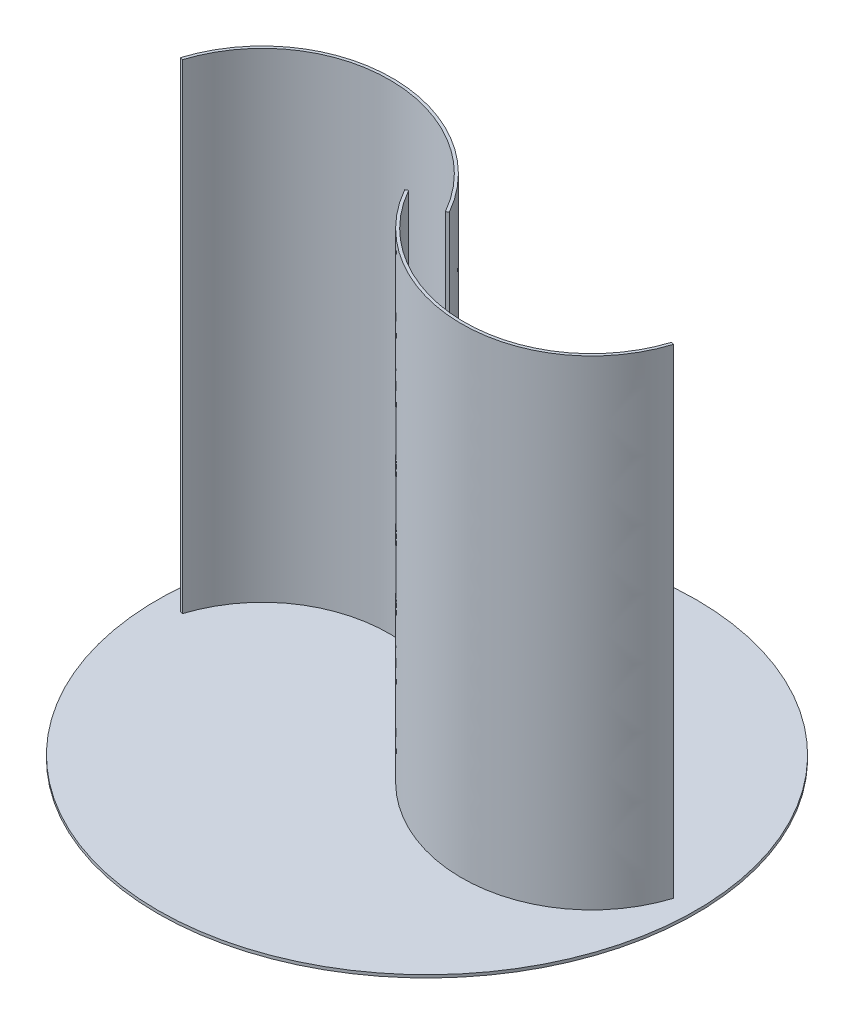
ISO-10303-21;
HEADER;
FILE_DESCRIPTION(('STEP AP214'),'2;1');
FILE_NAME('part.step','',(''),(''),'','','');
FILE_SCHEMA(('AUTOMOTIVE_DESIGN { 1 0 10303 214 1 1 1 1 }'));
ENDSEC;
DATA;
#1=APPLICATION_CONTEXT('core data for automotive mechanical design processes');
#2=APPLICATION_PROTOCOL_DEFINITION('international standard','automotive_design',2000,#1);
#3=PRODUCT_CONTEXT('',#1,'mechanical');
#4=PRODUCT('Part','Part','',(#3));
#5=PRODUCT_RELATED_PRODUCT_CATEGORY('part','',(#4));
#6=PRODUCT_DEFINITION_FORMATION('','',#4);
#7=PRODUCT_DEFINITION_CONTEXT('part definition',#1,'design');
#8=PRODUCT_DEFINITION('design','',#6,#7);
#9=PRODUCT_DEFINITION_SHAPE('','',#8);
#10=(LENGTH_UNIT() NAMED_UNIT(*) SI_UNIT(.MILLI.,.METRE.));
#11=(NAMED_UNIT(*) PLANE_ANGLE_UNIT() SI_UNIT($,.RADIAN.));
#12=(NAMED_UNIT(*) SI_UNIT($,.STERADIAN.) SOLID_ANGLE_UNIT());
#13=UNCERTAINTY_MEASURE_WITH_UNIT(LENGTH_MEASURE(1.E-05),#10,'distance_accuracy_value','');
#14=(GEOMETRIC_REPRESENTATION_CONTEXT(3) GLOBAL_UNCERTAINTY_ASSIGNED_CONTEXT((#13)) GLOBAL_UNIT_ASSIGNED_CONTEXT((#10,
#11,#12)) REPRESENTATION_CONTEXT('',''));
#15=CARTESIAN_POINT('',(0.,0.,0.));
#16=DIRECTION('',(0.,0.,1.));
#17=DIRECTION('',(1.,0.,0.));
#18=AXIS2_PLACEMENT_3D('',#15,#16,#17);
#19=CARTESIAN_POINT('',(0.,0.,0.));
#20=DIRECTION('',(0.,-1.,0.));
#21=DIRECTION('',(0.,0.,-1.));
#22=AXIS2_PLACEMENT_3D('',#19,#20,#21);
#23=PLANE('',#22);
#24=CARTESIAN_POINT('',(0.,0.,0.));
#25=DIRECTION('',(0.,-1.,0.));
#26=DIRECTION('',(0.,0.,-1.));
#27=AXIS2_PLACEMENT_3D('',#24,#25,#26);
#28=CIRCLE('',#27,280.5);
#29=CARTESIAN_POINT('',(0.,0.,-280.5));
#30=VERTEX_POINT('',#29);
#31=EDGE_CURVE('E167',#30,#30,#28,.T.);
#32=ORIENTED_EDGE('',*,*,#31,.F.);
#33=EDGE_LOOP('',(#32));
#34=FACE_BOUND('',#33,.T.);
#35=CARTESIAN_POINT('',(21.740731750354,0.,-1.46899537446169));
#36=CARTESIAN_POINT('',(17.9467319890899,0.,-8.22469100761498));
#37=CARTESIAN_POINT('',(13.6956014298501,0.,-14.7627837979923));
#38=CARTESIAN_POINT('',(4.36701714654338,0.,-27.2698374430347));
#39=CARTESIAN_POINT('',(-0.710373209559119,0.,-33.2387155133351));
#40=CARTESIAN_POINT('',(-11.5868735068799,0.,-44.4847835289915));
#41=CARTESIAN_POINT('',(-17.3859105000454,0.,-49.7618982515306));
#42=CARTESIAN_POINT('',(-29.5865901010145,0.,-59.515807860661));
#43=CARTESIAN_POINT('',(-35.9881517211022,0.,-63.992536752996));
#44=CARTESIAN_POINT('',(-49.2625717727742,0.,-72.0530918061298));
#45=CARTESIAN_POINT('',(-56.1353430960647,0.,-75.6368623012259));
#46=CARTESIAN_POINT('',(-70.2112080729492,0.,-81.8367950330199));
#47=CARTESIAN_POINT('',(-77.4142104418991,0.,-84.4529123029045));
#48=CARTESIAN_POINT('',(-92.002580634495,0.,-88.6622206269868));
#49=CARTESIAN_POINT('',(-99.3878544725272,0.,-90.2553770691896));
#50=CARTESIAN_POINT('',(-114.188612376991,0.,-92.3840251288786));
#51=CARTESIAN_POINT('',(-121.60400018296,0.,-92.9194918056077));
#52=CARTESIAN_POINT('',(-136.311486484476,0.,-92.9194918056077));
#53=CARTESIAN_POINT('',(-143.603485456939,0.,-92.3840097711626));
#54=CARTESIAN_POINT('',(-157.912281807875,0.,-90.2509194196274));
#55=CARTESIAN_POINT('',(-164.928974483966,0.,-88.6533072278839));
#56=CARTESIAN_POINT('',(-178.539889062721,0.,-84.4271379222835));
#57=CARTESIAN_POINT('',(-185.134000180228,0.,-81.7985932808461));
#58=CARTESIAN_POINT('',(-197.760357084658,0.,-75.5640076288594));
#59=CARTESIAN_POINT('',(-203.792489053723,0.,-71.9580022315376));
#60=CARTESIAN_POINT('',(-215.166754120739,0.,-63.8435161731332));
#61=CARTESIAN_POINT('',(-220.508778972944,0.,-59.3350991514192));
#62=CARTESIAN_POINT('',(-230.389326780364,0.,-49.5109090094193));
#63=CARTESIAN_POINT('',(-234.927758788005,0.,-44.1952260328479));
#64=CARTESIAN_POINT('',(-243.105282037317,0.,-32.8694007379295));
#65=CARTESIAN_POINT('',(-246.744308638366,0.,-26.8593662600262));
#66=CARTESIAN_POINT('',(-253.047209414797,0.,-14.2725028449885));
#67=CARTESIAN_POINT('',(-255.711047051068,0.,-7.69578770672673));
#68=CARTESIAN_POINT('',(-257.860174861961,0.,-0.905207025497276));
#69=B_SPLINE_CURVE_WITH_KNOTS('',3,(#35,#36,#37,#38,#39,#40,#41,#42,#43,#44,#45,#46,#47,#48,#49,
#50,#51,#52,#53,#54,#55,#56,#57,#58,#59,#60,#61,#62,#63,#64,#65,#66,#67,#68),.UNSPECIFIED.,.F.,
.F.,(4,2,2,2,2,2,2,2,2,2,2,2,2,2,2,2,4),(0.,0.0625,0.125,0.1875,0.25,0.3125,0.375,0.4375,0.5,
0.5625,0.625,0.6875,0.75,0.8125,0.875,0.9375,1.),.UNSPECIFIED.);
#70=CARTESIAN_POINT('',(21.740731750354,0.,-1.46899537446169));
#71=VERTEX_POINT('',#70);
#72=CARTESIAN_POINT('',(-257.860174861961,0.,-0.905207025497221));
#73=VERTEX_POINT('',#72);
#74=EDGE_CURVE('E221',#71,#73,#69,.T.);
#75=ORIENTED_EDGE('',*,*,#74,.F.);
#76=DIRECTION('',(-0.871910583451326,0.,0.489665124820594));
#77=VECTOR('',#76,1.);
#78=CARTESIAN_POINT('',(21.740731750354,0.,-1.46899537446169));
#79=LINE('',#78,#77);
#80=CARTESIAN_POINT('',(19.125,0.,0.));
#81=VERTEX_POINT('',#80);
#82=EDGE_CURVE('E235',#71,#81,#79,.T.);
#83=ORIENTED_EDGE('',*,*,#82,.T.);
#84=CARTESIAN_POINT('',(-110.450012937133,0.,61.0940258945179));
#85=DIRECTION('',(0.,1.,0.));
#86=DIRECTION('',(0.707106781186546,0.,0.707106781186549));
#87=AXIS2_PLACEMENT_3D('',#84,#85,#86);
#88=ELLIPSE('',#87,160.,141.457290573276);
#89=CARTESIAN_POINT('',(-255.,0.,0.));
#90=VERTEX_POINT('',#89);
#91=EDGE_CURVE('E232',#81,#90,#88,.T.);
#92=ORIENTED_EDGE('',*,*,#91,.T.);
#93=DIRECTION('',(-0.953391620653477,0.,-0.30173567516576));
#94=VECTOR('',#93,1.);
#95=CARTESIAN_POINT('',(-255.,0.,0.));
#96=LINE('',#95,#94);
#97=EDGE_CURVE('E225',#90,#73,#96,.T.);
#98=ORIENTED_EDGE('',*,*,#97,.T.);
#99=EDGE_LOOP('',(#75,#83,#92,#98));
#100=FACE_BOUND('',#99,.T.);
#101=CARTESIAN_POINT('',(-21.7407317503539,0.,1.46899537446185));
#102=CARTESIAN_POINT('',(-17.9467319890898,0.,8.22469100761514));
#103=CARTESIAN_POINT('',(-13.6956014298499,0.,14.7627837979924));
#104=CARTESIAN_POINT('',(-4.36701714654322,0.,27.2698374430349));
#105=CARTESIAN_POINT('',(0.710373209559285,0.,33.2387155133352));
#106=CARTESIAN_POINT('',(11.5868735068801,0.,44.4847835289917));
#107=CARTESIAN_POINT('',(17.3859105000456,0.,49.7618982515308));
#108=CARTESIAN_POINT('',(29.5865901010147,0.,59.5158078606612));
#109=CARTESIAN_POINT('',(35.9881517211024,0.,63.9925367529962));
#110=CARTESIAN_POINT('',(49.2625717727744,0.,72.0530918061299));
#111=CARTESIAN_POINT('',(56.1353430960649,0.,75.636862301226));
#112=CARTESIAN_POINT('',(70.2112080729494,0.,81.83679503302));
#113=CARTESIAN_POINT('',(77.4142104418993,0.,84.4529123029046));
#114=CARTESIAN_POINT('',(92.0025806344952,0.,88.662220626987));
#115=CARTESIAN_POINT('',(99.3878544725274,0.,90.2553770691898));
#116=CARTESIAN_POINT('',(114.188612376991,0.,92.3840251288788));
#117=CARTESIAN_POINT('',(121.604000182961,0.,92.9194918056078));
#118=CARTESIAN_POINT('',(136.311486484476,0.,92.9194918056077));
#119=CARTESIAN_POINT('',(143.603485456939,0.,92.3840097711627));
#120=CARTESIAN_POINT('',(157.912281807876,0.,90.2509194196275));
#121=CARTESIAN_POINT('',(164.928974483966,0.,88.6533072278841));
#122=CARTESIAN_POINT('',(178.539889062721,0.,84.4271379222836));
#123=CARTESIAN_POINT('',(185.134000180228,0.,81.7985932808462));
#124=CARTESIAN_POINT('',(197.760357084658,0.,75.5640076288596));
#125=CARTESIAN_POINT('',(203.792489053723,0.,71.9580022315376));
#126=CARTESIAN_POINT('',(215.166754120739,0.,63.8435161731333));
#127=CARTESIAN_POINT('',(220.508778972944,0.,59.3350991514192));
#128=CARTESIAN_POINT('',(230.389326780364,0.,49.5109090094194));
#129=CARTESIAN_POINT('',(234.927758788005,0.,44.195226032848));
#130=CARTESIAN_POINT('',(243.105282037317,0.,32.8694007379296));
#131=CARTESIAN_POINT('',(246.744308638366,0.,26.8593662600262));
#132=CARTESIAN_POINT('',(253.047209414797,0.,14.2725028449885));
#133=CARTESIAN_POINT('',(255.711047051068,0.,7.69578770672684));
#134=CARTESIAN_POINT('',(257.860174861961,0.,0.90520702549747));
#135=B_SPLINE_CURVE_WITH_KNOTS('',3,(#101,#102,#103,#104,#105,#106,#107,#108,#109,#110,#111,
#112,#113,#114,#115,#116,#117,#118,#119,#120,#121,#122,#123,#124,#125,#126,#127,#128,#129,#130,
#131,#132,#133,#134),.UNSPECIFIED.,.F.,.F.,(4,2,2,2,2,2,2,2,2,2,2,2,2,2,2,2,4),(0.,0.0625,0.125,
0.1875,0.25,0.3125,0.375,0.4375,0.5,0.5625,0.625,0.6875,0.75,0.8125,0.875,0.9375,1.),.UNSPECIFIED.);
#136=CARTESIAN_POINT('',(-21.7407317503539,0.,1.46899537446185));
#137=VERTEX_POINT('',#136);
#138=CARTESIAN_POINT('',(257.860174861961,0.,0.905207025497318));
#139=VERTEX_POINT('',#138);
#140=EDGE_CURVE('E163',#137,#139,#135,.T.);
#141=ORIENTED_EDGE('',*,*,#140,.F.);
#142=DIRECTION('',(0.871910583451325,0.,-0.489665124820595));
#143=VECTOR('',#142,1.);
#144=CARTESIAN_POINT('',(-21.7407317503539,0.,1.46899537446185));
#145=LINE('',#144,#143);
#146=CARTESIAN_POINT('',(-19.1249999999999,0.,0.));
#147=VERTEX_POINT('',#146);
#148=EDGE_CURVE('E157',#137,#147,#145,.T.);
#149=ORIENTED_EDGE('',*,*,#148,.T.);
#150=CARTESIAN_POINT('',(110.450012937133,0.,-61.0940258945178));
#151=DIRECTION('',(0.,1.,0.));
#152=DIRECTION('',(-0.707106781186546,0.,-0.707106781186549));
#153=AXIS2_PLACEMENT_3D('',#150,#151,#152);
#154=ELLIPSE('',#153,160.,141.457290573276);
#155=CARTESIAN_POINT('',(255.,0.,0.));
#156=VERTEX_POINT('',#155);
#157=EDGE_CURVE('E89',#147,#156,#154,.T.);
#158=ORIENTED_EDGE('',*,*,#157,.T.);
#159=DIRECTION('',(0.953391620653477,0.,0.301735675165758));
#160=VECTOR('',#159,1.);
#161=CARTESIAN_POINT('',(255.,0.,0.));
#162=LINE('',#161,#160);
#163=EDGE_CURVE('E267',#156,#139,#162,.T.);
#164=ORIENTED_EDGE('',*,*,#163,.T.);
#165=EDGE_LOOP('',(#141,#149,#158,#164));
#166=FACE_BOUND('',#165,.T.);
#167=ADVANCED_FACE('F73',(#34,#100,#166),#23,.F.);
#168=CARTESIAN_POINT('',(21.740731750354,500.,-1.46899537446169));
#169=CARTESIAN_POINT('',(17.9467319890899,500.,-8.22469100761498));
#170=CARTESIAN_POINT('',(13.6956014298501,500.,-14.7627837979923));
#171=CARTESIAN_POINT('',(4.36701714654338,500.,-27.2698374430347));
#172=CARTESIAN_POINT('',(-0.710373209559119,500.,-33.2387155133351));
#173=CARTESIAN_POINT('',(-11.5868735068799,500.,-44.4847835289915));
#174=CARTESIAN_POINT('',(-17.3859105000454,500.,-49.7618982515306));
#175=CARTESIAN_POINT('',(-29.5865901010145,500.,-59.515807860661));
#176=CARTESIAN_POINT('',(-35.9881517211022,500.,-63.992536752996));
#177=CARTESIAN_POINT('',(-49.2625717727742,500.,-72.0530918061298));
#178=CARTESIAN_POINT('',(-56.1353430960647,500.,-75.6368623012259));
#179=CARTESIAN_POINT('',(-70.2112080729492,500.,-81.8367950330199));
#180=CARTESIAN_POINT('',(-77.4142104418991,500.,-84.4529123029045));
#181=CARTESIAN_POINT('',(-92.002580634495,500.,-88.6622206269868));
#182=CARTESIAN_POINT('',(-99.3878544725272,500.,-90.2553770691896));
#183=CARTESIAN_POINT('',(-114.188612376991,500.,-92.3840251288786));
#184=CARTESIAN_POINT('',(-121.60400018296,500.,-92.9194918056077));
#185=CARTESIAN_POINT('',(-136.311486484476,500.,-92.9194918056077));
#186=CARTESIAN_POINT('',(-143.603485456939,500.,-92.3840097711626));
#187=CARTESIAN_POINT('',(-157.912281807875,500.,-90.2509194196274));
#188=CARTESIAN_POINT('',(-164.928974483966,500.,-88.6533072278839));
#189=CARTESIAN_POINT('',(-178.539889062721,500.,-84.4271379222835));
#190=CARTESIAN_POINT('',(-185.134000180228,500.,-81.7985932808461));
#191=CARTESIAN_POINT('',(-197.760357084658,500.,-75.5640076288594));
#192=CARTESIAN_POINT('',(-203.792489053723,500.,-71.9580022315376));
#193=CARTESIAN_POINT('',(-215.166754120739,500.,-63.8435161731332));
#194=CARTESIAN_POINT('',(-220.508778972944,500.,-59.3350991514192));
#195=CARTESIAN_POINT('',(-230.389326780364,500.,-49.5109090094193));
#196=CARTESIAN_POINT('',(-234.927758788005,500.,-44.1952260328479));
#197=CARTESIAN_POINT('',(-243.105282037317,500.,-32.8694007379295));
#198=CARTESIAN_POINT('',(-246.744308638366,500.,-26.8593662600262));
#199=CARTESIAN_POINT('',(-253.047209414797,500.,-14.2725028449885));
#200=CARTESIAN_POINT('',(-255.711047051068,500.,-7.69578770672673));
#201=CARTESIAN_POINT('',(-257.860174861961,500.,-0.905207025497276));
#202=B_SPLINE_CURVE_WITH_KNOTS('',3,(#168,#169,#170,#171,#172,#173,#174,#175,#176,#177,#178,
#179,#180,#181,#182,#183,#184,#185,#186,#187,#188,#189,#190,#191,#192,#193,#194,#195,#196,#197,
#198,#199,#200,#201),.UNSPECIFIED.,.F.,.F.,(4,2,2,2,2,2,2,2,2,2,2,2,2,2,2,2,4),(0.,0.0625,0.125,
0.1875,0.25,0.3125,0.375,0.4375,0.5,0.5625,0.625,0.6875,0.75,0.8125,0.875,0.9375,1.),.UNSPECIFIED.);
#203=DIRECTION('',(0.,-1.,0.));
#204=VECTOR('',#203,1.);
#205=SURFACE_OF_LINEAR_EXTRUSION('',#202,#204);
#206=ORIENTED_EDGE('',*,*,#74,.T.);
#207=DIRECTION('',(0.,-1.,0.));
#208=VECTOR('',#207,1.);
#209=CARTESIAN_POINT('',(-257.860174861961,500.,-0.905207025497221));
#210=LINE('',#209,#208);
#211=CARTESIAN_POINT('',(-257.860174861961,500.,-0.905207025497221));
#212=VERTEX_POINT('',#211);
#213=EDGE_CURVE('E12',#212,#73,#210,.T.);
#214=ORIENTED_EDGE('',*,*,#213,.F.);
#215=CARTESIAN_POINT('',(21.740731750354,500.,-1.46899537446169));
#216=VERTEX_POINT('',#215);
#217=EDGE_CURVE('E120',#216,#212,#202,.T.);
#218=ORIENTED_EDGE('',*,*,#217,.F.);
#219=DIRECTION('',(0.,-1.,0.));
#220=VECTOR('',#219,1.);
#221=CARTESIAN_POINT('',(21.740731750354,500.,-1.46899537446169));
#222=LINE('',#221,#220);
#223=EDGE_CURVE('E98',#216,#71,#222,.T.);
#224=ORIENTED_EDGE('',*,*,#223,.T.);
#225=EDGE_LOOP('',(#206,#214,#218,#224));
#226=FACE_BOUND('',#225,.T.);
#227=ADVANCED_FACE('F75',(#226),#205,.F.);
#228=CARTESIAN_POINT('',(-255.,500.,0.));
#229=DIRECTION('',(-0.30173567516576,0.,0.953391620653477));
#230=DIRECTION('',(0.953391620653477,0.,0.30173567516576));
#231=AXIS2_PLACEMENT_3D('',#228,#229,#230);
#232=PLANE('',#231);
#233=ORIENTED_EDGE('',*,*,#97,.F.);
#234=DIRECTION('',(0.,-1.,0.));
#235=VECTOR('',#234,1.);
#236=CARTESIAN_POINT('',(-255.,500.,0.));
#237=LINE('',#236,#235);
#238=CARTESIAN_POINT('',(-255.,500.,0.));
#239=VERTEX_POINT('',#238);
#240=EDGE_CURVE('E82',#239,#90,#237,.T.);
#241=ORIENTED_EDGE('',*,*,#240,.F.);
#242=DIRECTION('',(-0.953391620653477,0.,-0.30173567516576));
#243=VECTOR('',#242,1.);
#244=CARTESIAN_POINT('',(-255.,500.,0.));
#245=LINE('',#244,#243);
#246=EDGE_CURVE('E219',#239,#212,#245,.T.);
#247=ORIENTED_EDGE('',*,*,#246,.T.);
#248=ORIENTED_EDGE('',*,*,#213,.T.);
#249=EDGE_LOOP('',(#233,#241,#247,#248));
#250=FACE_BOUND('',#249,.T.);
#251=ADVANCED_FACE('F211',(#250),#232,.T.);
#252=CARTESIAN_POINT('',(-110.450012937133,500.,61.0940258945179));
#253=DIRECTION('',(0.,1.,0.));
#254=DIRECTION('',(0.707106781186546,0.,0.707106781186549));
#255=AXIS2_PLACEMENT_3D('',#252,#253,#254);
#256=ELLIPSE('',#255,160.,141.457290573276);
#257=DIRECTION('',(0.,-1.,0.));
#258=VECTOR('',#257,1.);
#259=SURFACE_OF_LINEAR_EXTRUSION('',#256,#258);
#260=ORIENTED_EDGE('',*,*,#91,.F.);
#261=DIRECTION('',(0.,-1.,0.));
#262=VECTOR('',#261,1.);
#263=CARTESIAN_POINT('',(19.125,500.,0.));
#264=LINE('',#263,#262);
#265=CARTESIAN_POINT('',(19.125,500.,0.));
#266=VERTEX_POINT('',#265);
#267=EDGE_CURVE('E239',#266,#81,#264,.T.);
#268=ORIENTED_EDGE('',*,*,#267,.F.);
#269=EDGE_CURVE('E213',#266,#239,#256,.T.);
#270=ORIENTED_EDGE('',*,*,#269,.T.);
#271=ORIENTED_EDGE('',*,*,#240,.T.);
#272=EDGE_LOOP('',(#260,#268,#270,#271));
#273=FACE_BOUND('',#272,.T.);
#274=ADVANCED_FACE('F208',(#273),#259,.T.);
#275=CARTESIAN_POINT('',(21.740731750354,500.,-1.46899537446169));
#276=DIRECTION('',(0.489665124820594,0.,0.871910583451326));
#277=DIRECTION('',(0.871910583451326,0.,-0.489665124820594));
#278=AXIS2_PLACEMENT_3D('',#275,#276,#277);
#279=PLANE('',#278);
#280=ORIENTED_EDGE('',*,*,#82,.F.);
#281=ORIENTED_EDGE('',*,*,#223,.F.);
#282=DIRECTION('',(-0.871910583451326,0.,0.489665124820594));
#283=VECTOR('',#282,1.);
#284=CARTESIAN_POINT('',(21.740731750354,500.,-1.46899537446169));
#285=LINE('',#284,#283);
#286=EDGE_CURVE('E218',#216,#266,#285,.T.);
#287=ORIENTED_EDGE('',*,*,#286,.T.);
#288=ORIENTED_EDGE('',*,*,#267,.T.);
#289=EDGE_LOOP('',(#280,#281,#287,#288));
#290=FACE_BOUND('',#289,.T.);
#291=ADVANCED_FACE('F205',(#290),#279,.T.);
#292=CARTESIAN_POINT('',(-128.957743333718,500.,-92.9194918056077));
#293=DIRECTION('',(0.,-1.,0.));
#294=DIRECTION('',(-1.,0.,0.));
#295=AXIS2_PLACEMENT_3D('',#292,#293,#294);
#296=PLANE('',#295);
#297=ORIENTED_EDGE('',*,*,#217,.T.);
#298=ORIENTED_EDGE('',*,*,#246,.F.);
#299=ORIENTED_EDGE('',*,*,#269,.F.);
#300=ORIENTED_EDGE('',*,*,#286,.F.);
#301=EDGE_LOOP('',(#297,#298,#299,#300));
#302=FACE_BOUND('',#301,.T.);
#303=ADVANCED_FACE('F201',(#302),#296,.F.);
#304=CARTESIAN_POINT('',(0.,-3.,0.));
#305=DIRECTION('',(0.,1.,0.));
#306=DIRECTION('',(0.,0.,1.));
#307=AXIS2_PLACEMENT_3D('',#304,#305,#306);
#308=CYLINDRICAL_SURFACE('',#307,280.5);
#309=CARTESIAN_POINT('',(0.,-3.,0.));
#310=DIRECTION('',(0.,-1.,0.));
#311=DIRECTION('',(0.,0.,-1.));
#312=AXIS2_PLACEMENT_3D('',#309,#310,#311);
#313=CIRCLE('',#312,280.5);
#314=CARTESIAN_POINT('',(0.,-3.,-280.5));
#315=VERTEX_POINT('',#314);
#316=EDGE_CURVE('E226',#315,#315,#313,.T.);
#317=ORIENTED_EDGE('',*,*,#316,.F.);
#318=EDGE_LOOP('',(#317));
#319=FACE_BOUND('',#318,.T.);
#320=ORIENTED_EDGE('',*,*,#31,.T.);
#321=EDGE_LOOP('',(#320));
#322=FACE_BOUND('',#321,.T.);
#323=ADVANCED_FACE('F194',(#319,#322),#308,.T.);
#324=CARTESIAN_POINT('',(0.,-3.,0.));
#325=DIRECTION('',(0.,-1.,0.));
#326=DIRECTION('',(0.,0.,-1.));
#327=AXIS2_PLACEMENT_3D('',#324,#325,#326);
#328=PLANE('',#327);
#329=ORIENTED_EDGE('',*,*,#316,.T.);
#330=EDGE_LOOP('',(#329));
#331=FACE_BOUND('',#330,.T.);
#332=ADVANCED_FACE('F191',(#331),#328,.T.);
#333=CARTESIAN_POINT('',(-21.7407317503539,500.,1.46899537446185));
#334=CARTESIAN_POINT('',(-17.9467319890898,500.,8.22469100761514));
#335=CARTESIAN_POINT('',(-13.6956014298499,500.,14.7627837979924));
#336=CARTESIAN_POINT('',(-4.36701714654322,500.,27.2698374430349));
#337=CARTESIAN_POINT('',(0.710373209559285,500.,33.2387155133352));
#338=CARTESIAN_POINT('',(11.5868735068801,500.,44.4847835289917));
#339=CARTESIAN_POINT('',(17.3859105000456,500.,49.7618982515308));
#340=CARTESIAN_POINT('',(29.5865901010147,500.,59.5158078606612));
#341=CARTESIAN_POINT('',(35.9881517211024,500.,63.9925367529962));
#342=CARTESIAN_POINT('',(49.2625717727744,500.,72.0530918061299));
#343=CARTESIAN_POINT('',(56.1353430960649,500.,75.636862301226));
#344=CARTESIAN_POINT('',(70.2112080729494,500.,81.83679503302));
#345=CARTESIAN_POINT('',(77.4142104418993,500.,84.4529123029046));
#346=CARTESIAN_POINT('',(92.0025806344952,500.,88.662220626987));
#347=CARTESIAN_POINT('',(99.3878544725274,500.,90.2553770691898));
#348=CARTESIAN_POINT('',(114.188612376991,500.,92.3840251288788));
#349=CARTESIAN_POINT('',(121.604000182961,500.,92.9194918056078));
#350=CARTESIAN_POINT('',(136.311486484476,500.,92.9194918056077));
#351=CARTESIAN_POINT('',(143.603485456939,500.,92.3840097711627));
#352=CARTESIAN_POINT('',(157.912281807876,500.,90.2509194196275));
#353=CARTESIAN_POINT('',(164.928974483966,500.,88.6533072278841));
#354=CARTESIAN_POINT('',(178.539889062721,500.,84.4271379222836));
#355=CARTESIAN_POINT('',(185.134000180228,500.,81.7985932808462));
#356=CARTESIAN_POINT('',(197.760357084658,500.,75.5640076288596));
#357=CARTESIAN_POINT('',(203.792489053723,500.,71.9580022315376));
#358=CARTESIAN_POINT('',(215.166754120739,500.,63.8435161731333));
#359=CARTESIAN_POINT('',(220.508778972944,500.,59.3350991514192));
#360=CARTESIAN_POINT('',(230.389326780364,500.,49.5109090094194));
#361=CARTESIAN_POINT('',(234.927758788005,500.,44.195226032848));
#362=CARTESIAN_POINT('',(243.105282037317,500.,32.8694007379296));
#363=CARTESIAN_POINT('',(246.744308638366,500.,26.8593662600262));
#364=CARTESIAN_POINT('',(253.047209414797,500.,14.2725028449885));
#365=CARTESIAN_POINT('',(255.711047051068,500.,7.69578770672684));
#366=CARTESIAN_POINT('',(257.860174861961,500.,0.90520702549747));
#367=B_SPLINE_CURVE_WITH_KNOTS('',3,(#333,#334,#335,#336,#337,#338,#339,#340,#341,#342,#343,
#344,#345,#346,#347,#348,#349,#350,#351,#352,#353,#354,#355,#356,#357,#358,#359,#360,#361,#362,
#363,#364,#365,#366),.UNSPECIFIED.,.F.,.F.,(4,2,2,2,2,2,2,2,2,2,2,2,2,2,2,2,4),(0.,0.0625,0.125,
0.1875,0.25,0.3125,0.375,0.4375,0.5,0.5625,0.625,0.6875,0.75,0.8125,0.875,0.9375,1.),.UNSPECIFIED.);
#368=DIRECTION('',(0.,-1.,0.));
#369=VECTOR('',#368,1.);
#370=SURFACE_OF_LINEAR_EXTRUSION('',#367,#369);
#371=ORIENTED_EDGE('',*,*,#140,.T.);
#372=DIRECTION('',(0.,-1.,0.));
#373=VECTOR('',#372,1.);
#374=CARTESIAN_POINT('',(257.860174861961,500.,0.905207025497318));
#375=LINE('',#374,#373);
#376=CARTESIAN_POINT('',(257.860174861961,500.,0.905207025497318));
#377=VERTEX_POINT('',#376);
#378=EDGE_CURVE('E160',#377,#139,#375,.T.);
#379=ORIENTED_EDGE('',*,*,#378,.F.);
#380=CARTESIAN_POINT('',(-21.7407317503539,500.,1.46899537446185));
#381=VERTEX_POINT('',#380);
#382=EDGE_CURVE('E147',#381,#377,#367,.T.);
#383=ORIENTED_EDGE('',*,*,#382,.F.);
#384=DIRECTION('',(0.,-1.,0.));
#385=VECTOR('',#384,1.);
#386=CARTESIAN_POINT('',(-21.7407317503539,500.,1.46899537446185));
#387=LINE('',#386,#385);
#388=EDGE_CURVE('E262',#381,#137,#387,.T.);
#389=ORIENTED_EDGE('',*,*,#388,.T.);
#390=EDGE_LOOP('',(#371,#379,#383,#389));
#391=FACE_BOUND('',#390,.T.);
#392=ADVANCED_FACE('F161',(#391),#370,.F.);
#393=CARTESIAN_POINT('',(255.,500.,0.));
#394=DIRECTION('',(0.301735675165759,0.,-0.953391620653477));
#395=DIRECTION('',(-0.953391620653477,0.,-0.301735675165759));
#396=AXIS2_PLACEMENT_3D('',#393,#394,#395);
#397=PLANE('',#396);
#398=ORIENTED_EDGE('',*,*,#163,.F.);
#399=DIRECTION('',(0.,-1.,0.));
#400=VECTOR('',#399,1.);
#401=CARTESIAN_POINT('',(255.,500.,0.));
#402=LINE('',#401,#400);
#403=CARTESIAN_POINT('',(255.,500.,0.));
#404=VERTEX_POINT('',#403);
#405=EDGE_CURVE('E168',#404,#156,#402,.T.);
#406=ORIENTED_EDGE('',*,*,#405,.F.);
#407=DIRECTION('',(0.953391620653477,0.,0.301735675165758));
#408=VECTOR('',#407,1.);
#409=CARTESIAN_POINT('',(255.,500.,0.));
#410=LINE('',#409,#408);
#411=EDGE_CURVE('E152',#404,#377,#410,.T.);
#412=ORIENTED_EDGE('',*,*,#411,.T.);
#413=ORIENTED_EDGE('',*,*,#378,.T.);
#414=EDGE_LOOP('',(#398,#406,#412,#413));
#415=FACE_BOUND('',#414,.T.);
#416=ADVANCED_FACE('F170',(#415),#397,.T.);
#417=CARTESIAN_POINT('',(110.450012937133,500.,-61.0940258945178));
#418=DIRECTION('',(0.,1.,0.));
#419=DIRECTION('',(-0.707106781186546,0.,-0.707106781186549));
#420=AXIS2_PLACEMENT_3D('',#417,#418,#419);
#421=ELLIPSE('',#420,160.,141.457290573276);
#422=DIRECTION('',(0.,-1.,0.));
#423=VECTOR('',#422,1.);
#424=SURFACE_OF_LINEAR_EXTRUSION('',#421,#423);
#425=ORIENTED_EDGE('',*,*,#157,.F.);
#426=DIRECTION('',(0.,-1.,0.));
#427=VECTOR('',#426,1.);
#428=CARTESIAN_POINT('',(-19.1249999999999,500.,0.));
#429=LINE('',#428,#427);
#430=CARTESIAN_POINT('',(-19.1249999999999,500.,0.));
#431=VERTEX_POINT('',#430);
#432=EDGE_CURVE('E260',#431,#147,#429,.T.);
#433=ORIENTED_EDGE('',*,*,#432,.F.);
#434=EDGE_CURVE('E171',#431,#404,#421,.T.);
#435=ORIENTED_EDGE('',*,*,#434,.T.);
#436=ORIENTED_EDGE('',*,*,#405,.T.);
#437=EDGE_LOOP('',(#425,#433,#435,#436));
#438=FACE_BOUND('',#437,.T.);
#439=ADVANCED_FACE('F181',(#438),#424,.T.);
#440=CARTESIAN_POINT('',(-21.7407317503539,500.,1.46899537446185));
#441=DIRECTION('',(-0.489665124820595,0.,-0.871910583451326));
#442=DIRECTION('',(-0.871910583451325,0.,0.489665124820595));
#443=AXIS2_PLACEMENT_3D('',#440,#441,#442);
#444=PLANE('',#443);
#445=ORIENTED_EDGE('',*,*,#148,.F.);
#446=ORIENTED_EDGE('',*,*,#388,.F.);
#447=DIRECTION('',(0.871910583451325,0.,-0.489665124820595));
#448=VECTOR('',#447,1.);
#449=CARTESIAN_POINT('',(-21.7407317503539,500.,1.46899537446185));
#450=LINE('',#449,#448);
#451=EDGE_CURVE('E155',#381,#431,#450,.T.);
#452=ORIENTED_EDGE('',*,*,#451,.T.);
#453=ORIENTED_EDGE('',*,*,#432,.T.);
#454=EDGE_LOOP('',(#445,#446,#452,#453));
#455=FACE_BOUND('',#454,.T.);
#456=ADVANCED_FACE('F185',(#455),#444,.T.);
#457=CARTESIAN_POINT('',(128.957743333718,500.,92.9194918056077));
#458=DIRECTION('',(0.,-1.,0.));
#459=DIRECTION('',(-1.,0.,0.));
#460=AXIS2_PLACEMENT_3D('',#457,#458,#459);
#461=PLANE('',#460);
#462=ORIENTED_EDGE('',*,*,#382,.T.);
#463=ORIENTED_EDGE('',*,*,#411,.F.);
#464=ORIENTED_EDGE('',*,*,#434,.F.);
#465=ORIENTED_EDGE('',*,*,#451,.F.);
#466=EDGE_LOOP('',(#462,#463,#464,#465));
#467=FACE_BOUND('',#466,.T.);
#468=ADVANCED_FACE('F149',(#467),#461,.F.);
#469=CLOSED_SHELL('',(#167,#227,#251,#274,#291,#303,#323,#332,#392,#416,#439,#456,#468));
#470=MANIFOLD_SOLID_BREP('B2',#469);
#471=ADVANCED_BREP_SHAPE_REPRESENTATION('',(#18,#470),#14);
#472=SHAPE_DEFINITION_REPRESENTATION(#9,#471);
ENDSEC;
END-ISO-10303-21;
